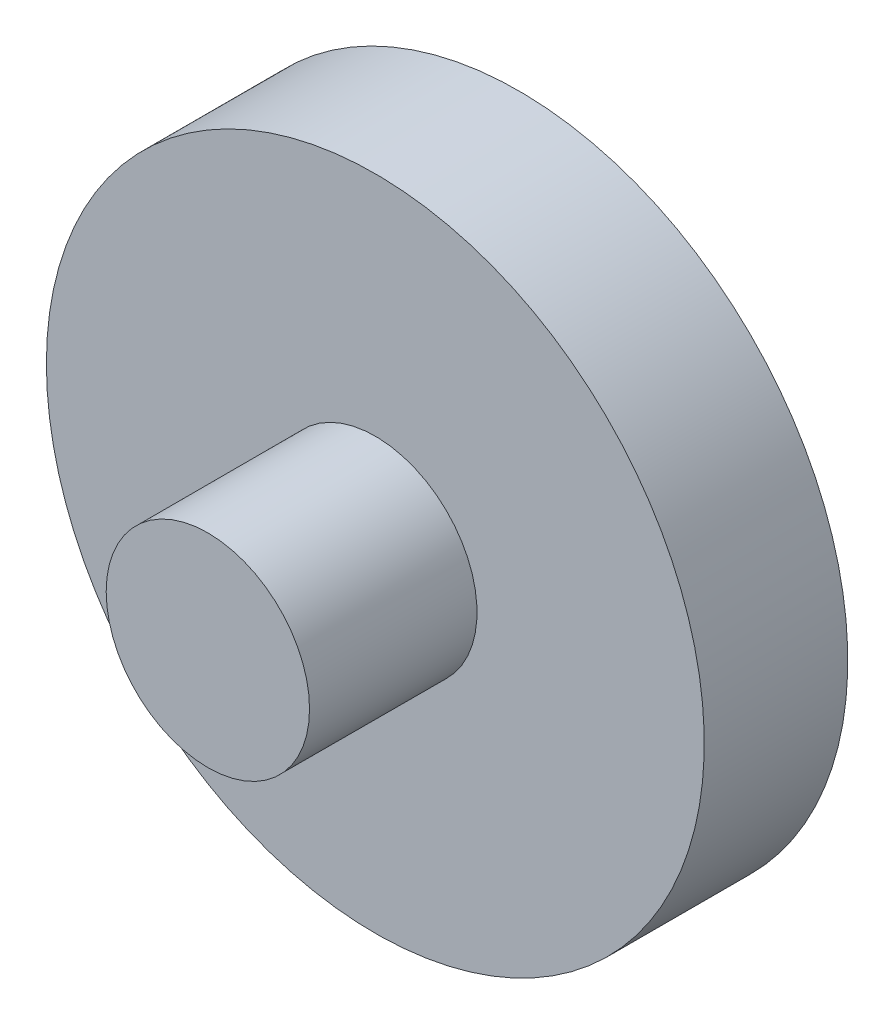
ISO-10303-21;
HEADER;
FILE_DESCRIPTION(('STEP AP214'),'2;1');
FILE_NAME('part.step','',(''),(''),'','','');
FILE_SCHEMA(('AUTOMOTIVE_DESIGN { 1 0 10303 214 1 1 1 1 }'));
ENDSEC;
DATA;
#1=APPLICATION_CONTEXT('core data for automotive mechanical design processes');
#2=APPLICATION_PROTOCOL_DEFINITION('international standard','automotive_design',2000,#1);
#3=PRODUCT_CONTEXT('',#1,'mechanical');
#4=PRODUCT('Part','Part','',(#3));
#5=PRODUCT_RELATED_PRODUCT_CATEGORY('part','',(#4));
#6=PRODUCT_DEFINITION_FORMATION('','',#4);
#7=PRODUCT_DEFINITION_CONTEXT('part definition',#1,'design');
#8=PRODUCT_DEFINITION('design','',#6,#7);
#9=PRODUCT_DEFINITION_SHAPE('','',#8);
#10=(LENGTH_UNIT() NAMED_UNIT(*) SI_UNIT(.MILLI.,.METRE.));
#11=(NAMED_UNIT(*) PLANE_ANGLE_UNIT() SI_UNIT($,.RADIAN.));
#12=(NAMED_UNIT(*) SI_UNIT($,.STERADIAN.) SOLID_ANGLE_UNIT());
#13=UNCERTAINTY_MEASURE_WITH_UNIT(LENGTH_MEASURE(1.E-05),#10,'distance_accuracy_value','');
#14=(GEOMETRIC_REPRESENTATION_CONTEXT(3) GLOBAL_UNCERTAINTY_ASSIGNED_CONTEXT((#13)) GLOBAL_UNIT_ASSIGNED_CONTEXT((#10,
#11,#12)) REPRESENTATION_CONTEXT('',''));
#15=CARTESIAN_POINT('',(0.,0.,0.));
#16=DIRECTION('',(0.,0.,1.));
#17=DIRECTION('',(1.,0.,0.));
#18=AXIS2_PLACEMENT_3D('',#15,#16,#17);
#19=CARTESIAN_POINT('',(0.,0.,10.));
#20=DIRECTION('',(0.,0.,-1.));
#21=DIRECTION('',(-1.,0.,0.));
#22=AXIS2_PLACEMENT_3D('',#19,#20,#21);
#23=CYLINDRICAL_SURFACE('',#22,8.5);
#24=CARTESIAN_POINT('',(0.,0.,10.));
#25=DIRECTION('',(0.,0.,1.));
#26=DIRECTION('',(1.,0.,0.));
#27=AXIS2_PLACEMENT_3D('',#24,#25,#26);
#28=CIRCLE('',#27,8.5);
#29=CARTESIAN_POINT('',(8.5,0.,10.));
#30=VERTEX_POINT('',#29);
#31=EDGE_CURVE('E40',#30,#30,#28,.T.);
#32=ORIENTED_EDGE('',*,*,#31,.F.);
#33=EDGE_LOOP('',(#32));
#34=FACE_BOUND('',#33,.T.);
#35=CARTESIAN_POINT('',(0.,0.,-4.));
#36=DIRECTION('',(0.,0.,-1.));
#37=DIRECTION('',(-1.,0.,0.));
#38=AXIS2_PLACEMENT_3D('',#35,#36,#37);
#39=CIRCLE('',#38,8.5);
#40=CARTESIAN_POINT('',(-8.5,0.,-4.));
#41=VERTEX_POINT('',#40);
#42=EDGE_CURVE('E10',#41,#41,#39,.T.);
#43=ORIENTED_EDGE('',*,*,#42,.F.);
#44=EDGE_LOOP('',(#43));
#45=FACE_BOUND('',#44,.T.);
#46=ADVANCED_FACE('F34',(#34,#45),#23,.T.);
#47=CARTESIAN_POINT('',(0.,0.,10.));
#48=DIRECTION('',(0.,0.,1.));
#49=DIRECTION('',(1.,0.,0.));
#50=AXIS2_PLACEMENT_3D('',#47,#48,#49);
#51=PLANE('',#50);
#52=ORIENTED_EDGE('',*,*,#31,.T.);
#53=EDGE_LOOP('',(#52));
#54=FACE_BOUND('',#53,.T.);
#55=ADVANCED_FACE('F67',(#54),#51,.T.);
#56=CARTESIAN_POINT('',(0.,0.,-16.));
#57=DIRECTION('',(0.,0.,1.));
#58=DIRECTION('',(1.,0.,0.));
#59=AXIS2_PLACEMENT_3D('',#56,#57,#58);
#60=CYLINDRICAL_SURFACE('',#59,27.5);
#61=CARTESIAN_POINT('',(0.,0.,-16.));
#62=DIRECTION('',(0.,0.,-1.));
#63=DIRECTION('',(-1.,0.,0.));
#64=AXIS2_PLACEMENT_3D('',#61,#62,#63);
#65=CIRCLE('',#64,27.5);
#66=CARTESIAN_POINT('',(-27.5,0.,-16.));
#67=VERTEX_POINT('',#66);
#68=EDGE_CURVE('E44',#67,#67,#65,.T.);
#69=ORIENTED_EDGE('',*,*,#68,.F.);
#70=EDGE_LOOP('',(#69));
#71=FACE_BOUND('',#70,.T.);
#72=CARTESIAN_POINT('',(0.,0.,-4.));
#73=DIRECTION('',(0.,0.,-1.));
#74=DIRECTION('',(-1.,0.,0.));
#75=AXIS2_PLACEMENT_3D('',#72,#73,#74);
#76=CIRCLE('',#75,27.5);
#77=CARTESIAN_POINT('',(-27.5,0.,-4.));
#78=VERTEX_POINT('',#77);
#79=EDGE_CURVE('E48',#78,#78,#76,.T.);
#80=ORIENTED_EDGE('',*,*,#79,.T.);
#81=EDGE_LOOP('',(#80));
#82=FACE_BOUND('',#81,.T.);
#83=ADVANCED_FACE('F54',(#71,#82),#60,.T.);
#84=CARTESIAN_POINT('',(0.,0.,-16.));
#85=DIRECTION('',(0.,0.,-1.));
#86=DIRECTION('',(-1.,0.,0.));
#87=AXIS2_PLACEMENT_3D('',#84,#85,#86);
#88=PLANE('',#87);
#89=ORIENTED_EDGE('',*,*,#68,.T.);
#90=EDGE_LOOP('',(#89));
#91=FACE_BOUND('',#90,.T.);
#92=ADVANCED_FACE('F58',(#91),#88,.T.);
#93=CARTESIAN_POINT('',(0.,0.,-4.));
#94=DIRECTION('',(0.,0.,-1.));
#95=DIRECTION('',(-1.,0.,0.));
#96=AXIS2_PLACEMENT_3D('',#93,#94,#95);
#97=PLANE('',#96);
#98=ORIENTED_EDGE('',*,*,#42,.T.);
#99=EDGE_LOOP('',(#98));
#100=FACE_BOUND('',#99,.T.);
#101=ORIENTED_EDGE('',*,*,#79,.F.);
#102=EDGE_LOOP('',(#101));
#103=FACE_BOUND('',#102,.T.);
#104=ADVANCED_FACE('F56',(#100,#103),#97,.F.);
#105=CLOSED_SHELL('',(#46,#55,#83,#92,#104));
#106=MANIFOLD_SOLID_BREP('B2',#105);
#107=ADVANCED_BREP_SHAPE_REPRESENTATION('',(#18,#106),#14);
#108=SHAPE_DEFINITION_REPRESENTATION(#9,#107);
ENDSEC;
END-ISO-10303-21;
